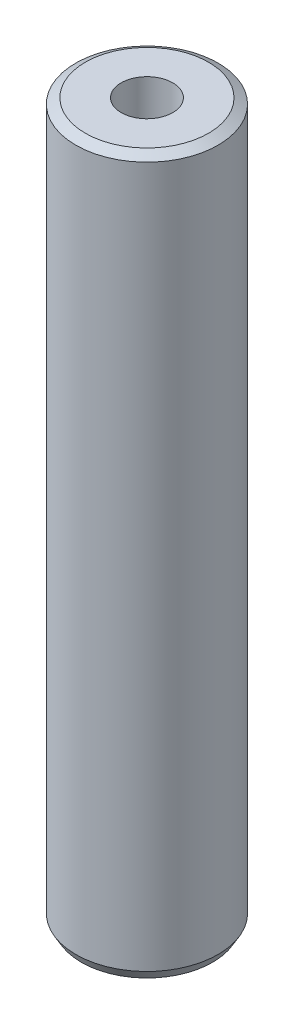
ISO-10303-21;
HEADER;
FILE_DESCRIPTION(('STEP AP214'),'2;1');
FILE_NAME('part.step','',(''),(''),'','','');
FILE_SCHEMA(('AUTOMOTIVE_DESIGN { 1 0 10303 214 1 1 1 1 }'));
ENDSEC;
DATA;
#1=APPLICATION_CONTEXT('core data for automotive mechanical design processes');
#2=APPLICATION_PROTOCOL_DEFINITION('international standard','automotive_design',2000,#1);
#3=PRODUCT_CONTEXT('',#1,'mechanical');
#4=PRODUCT('Part','Part','',(#3));
#5=PRODUCT_RELATED_PRODUCT_CATEGORY('part','',(#4));
#6=PRODUCT_DEFINITION_FORMATION('','',#4);
#7=PRODUCT_DEFINITION_CONTEXT('part definition',#1,'design');
#8=PRODUCT_DEFINITION('design','',#6,#7);
#9=PRODUCT_DEFINITION_SHAPE('','',#8);
#10=(LENGTH_UNIT() NAMED_UNIT(*) SI_UNIT(.MILLI.,.METRE.));
#11=(NAMED_UNIT(*) PLANE_ANGLE_UNIT() SI_UNIT($,.RADIAN.));
#12=(NAMED_UNIT(*) SI_UNIT($,.STERADIAN.) SOLID_ANGLE_UNIT());
#13=UNCERTAINTY_MEASURE_WITH_UNIT(LENGTH_MEASURE(1.E-05),#10,'distance_accuracy_value','');
#14=(GEOMETRIC_REPRESENTATION_CONTEXT(3) GLOBAL_UNCERTAINTY_ASSIGNED_CONTEXT((#13)) GLOBAL_UNIT_ASSIGNED_CONTEXT((#10,
#11,#12)) REPRESENTATION_CONTEXT('',''));
#15=CARTESIAN_POINT('',(0.,0.,0.));
#16=DIRECTION('',(0.,0.,1.));
#17=DIRECTION('',(1.,0.,0.));
#18=AXIS2_PLACEMENT_3D('',#15,#16,#17);
#19=CARTESIAN_POINT('',(0.,578.496611432403,0.));
#20=DIRECTION('',(0.,-1.,0.));
#21=DIRECTION('',(0.,0.,-1.));
#22=AXIS2_PLACEMENT_3D('',#19,#20,#21);
#23=CYLINDRICAL_SURFACE('',#22,57.5);
#24=CARTESIAN_POINT('',(0.,574.031161658504,0.));
#25=DIRECTION('',(0.,1.,0.));
#26=DIRECTION('',(0.,0.,1.));
#27=AXIS2_PLACEMENT_3D('',#24,#25,#26);
#28=CIRCLE('',#27,57.5);
#29=CARTESIAN_POINT('',(0.,574.031161658504,57.5));
#30=VERTEX_POINT('',#29);
#31=EDGE_CURVE('E50',#30,#30,#28,.F.);
#32=ORIENTED_EDGE('',*,*,#31,.T.);
#33=EDGE_LOOP('',(#32));
#34=FACE_BOUND('',#33,.T.);
#35=CARTESIAN_POINT('',(0.,7.73438588703901,0.));
#36=DIRECTION('',(0.,1.,0.));
#37=DIRECTION('',(0.,0.,1.));
#38=AXIS2_PLACEMENT_3D('',#35,#36,#37);
#39=CIRCLE('',#38,57.5);
#40=CARTESIAN_POINT('',(0.,7.73438588703901,57.5));
#41=VERTEX_POINT('',#40);
#42=EDGE_CURVE('E51',#41,#41,#39,.T.);
#43=ORIENTED_EDGE('',*,*,#42,.T.);
#44=EDGE_LOOP('',(#43));
#45=FACE_BOUND('',#44,.T.);
#46=ADVANCED_FACE('F39',(#34,#45),#23,.T.);
#47=CARTESIAN_POINT('',(0.,578.496611432403,0.));
#48=DIRECTION('',(0.,1.,0.));
#49=DIRECTION('',(0.,0.,1.));
#50=AXIS2_PLACEMENT_3D('',#47,#48,#49);
#51=PLANE('',#50);
#52=CARTESIAN_POINT('',(0.,578.496611432403,0.));
#53=DIRECTION('',(0.,1.,0.));
#54=DIRECTION('',(0.,0.,1.));
#55=AXIS2_PLACEMENT_3D('',#52,#53,#54);
#56=CIRCLE('',#55,49.7656141129612);
#57=CARTESIAN_POINT('',(0.,578.496611432403,49.7656141129612));
#58=VERTEX_POINT('',#57);
#59=EDGE_CURVE('E54',#58,#58,#56,.T.);
#60=ORIENTED_EDGE('',*,*,#59,.T.);
#61=EDGE_LOOP('',(#60));
#62=FACE_BOUND('',#61,.T.);
#63=CARTESIAN_POINT('',(0.,578.496611432403,0.));
#64=DIRECTION('',(0.,1.,0.));
#65=DIRECTION('',(0.,0.,1.));
#66=AXIS2_PLACEMENT_3D('',#63,#64,#65);
#67=CIRCLE('',#66,20.8580663811484);
#68=CARTESIAN_POINT('',(0.,578.496611432403,20.8580663811484));
#69=VERTEX_POINT('',#68);
#70=EDGE_CURVE('E58',#69,#69,#67,.T.);
#71=ORIENTED_EDGE('',*,*,#70,.F.);
#72=EDGE_LOOP('',(#71));
#73=FACE_BOUND('',#72,.T.);
#74=ADVANCED_FACE('F69',(#62,#73),#51,.T.);
#75=CARTESIAN_POINT('',(0.,0.,0.));
#76=DIRECTION('',(0.,1.,0.));
#77=DIRECTION('',(0.,0.,1.));
#78=AXIS2_PLACEMENT_3D('',#75,#76,#77);
#79=PLANE('',#78);
#80=CARTESIAN_POINT('',(0.,0.,0.));
#81=DIRECTION('',(0.,1.,0.));
#82=DIRECTION('',(0.,0.,1.));
#83=AXIS2_PLACEMENT_3D('',#80,#81,#82);
#84=CIRCLE('',#83,53.0345502261016);
#85=CARTESIAN_POINT('',(0.,0.,53.0345502261016));
#86=VERTEX_POINT('',#85);
#87=EDGE_CURVE('E10',#86,#86,#84,.F.);
#88=ORIENTED_EDGE('',*,*,#87,.T.);
#89=EDGE_LOOP('',(#88));
#90=FACE_BOUND('',#89,.T.);
#91=CARTESIAN_POINT('',(0.,0.,0.));
#92=DIRECTION('',(0.,1.,0.));
#93=DIRECTION('',(0.,0.,1.));
#94=AXIS2_PLACEMENT_3D('',#91,#92,#93);
#95=CIRCLE('',#94,20.8580663811484);
#96=CARTESIAN_POINT('',(0.,0.,20.8580663811484));
#97=VERTEX_POINT('',#96);
#98=EDGE_CURVE('E63',#97,#97,#95,.T.);
#99=ORIENTED_EDGE('',*,*,#98,.T.);
#100=EDGE_LOOP('',(#99));
#101=FACE_BOUND('',#100,.T.);
#102=ADVANCED_FACE('F75',(#90,#101),#79,.F.);
#103=CARTESIAN_POINT('',(0.,578.496611432403,0.));
#104=DIRECTION('',(0.,-1.,0.));
#105=DIRECTION('',(0.,0.,-1.));
#106=AXIS2_PLACEMENT_3D('',#103,#104,#105);
#107=CYLINDRICAL_SURFACE('',#106,20.8580663811484);
#108=ORIENTED_EDGE('',*,*,#70,.T.);
#109=EDGE_LOOP('',(#108));
#110=FACE_BOUND('',#109,.T.);
#111=ORIENTED_EDGE('',*,*,#98,.F.);
#112=EDGE_LOOP('',(#111));
#113=FACE_BOUND('',#112,.T.);
#114=ADVANCED_FACE('F70',(#110,#113),#107,.F.);
#115=CARTESIAN_POINT('',(0.,578.496611432403,0.));
#116=DIRECTION('',(0.,-1.,0.));
#117=DIRECTION('',(0.,0.,-1.));
#118=AXIS2_PLACEMENT_3D('',#115,#116,#117);
#119=CONICAL_SURFACE('',#118,49.7656141129612,1.0471975511966);
#120=ORIENTED_EDGE('',*,*,#31,.F.);
#121=EDGE_LOOP('',(#120));
#122=FACE_BOUND('',#121,.T.);
#123=ORIENTED_EDGE('',*,*,#59,.F.);
#124=EDGE_LOOP('',(#123));
#125=FACE_BOUND('',#124,.T.);
#126=ADVANCED_FACE('F81',(#122,#125),#119,.T.);
#127=CARTESIAN_POINT('',(0.,7.73438588703901,0.));
#128=DIRECTION('',(0.,1.,0.));
#129=DIRECTION('',(0.,0.,1.));
#130=AXIS2_PLACEMENT_3D('',#127,#128,#129);
#131=CONICAL_SURFACE('',#130,57.5,0.523598775598298);
#132=ORIENTED_EDGE('',*,*,#87,.F.);
#133=EDGE_LOOP('',(#132));
#134=FACE_BOUND('',#133,.T.);
#135=ORIENTED_EDGE('',*,*,#42,.F.);
#136=EDGE_LOOP('',(#135));
#137=FACE_BOUND('',#136,.T.);
#138=ADVANCED_FACE('F45',(#134,#137),#131,.T.);
#139=CLOSED_SHELL('',(#46,#74,#102,#114,#126,#138));
#140=MANIFOLD_SOLID_BREP('B2',#139);
#141=ADVANCED_BREP_SHAPE_REPRESENTATION('',(#18,#140),#14);
#142=SHAPE_DEFINITION_REPRESENTATION(#9,#141);
ENDSEC;
END-ISO-10303-21;
